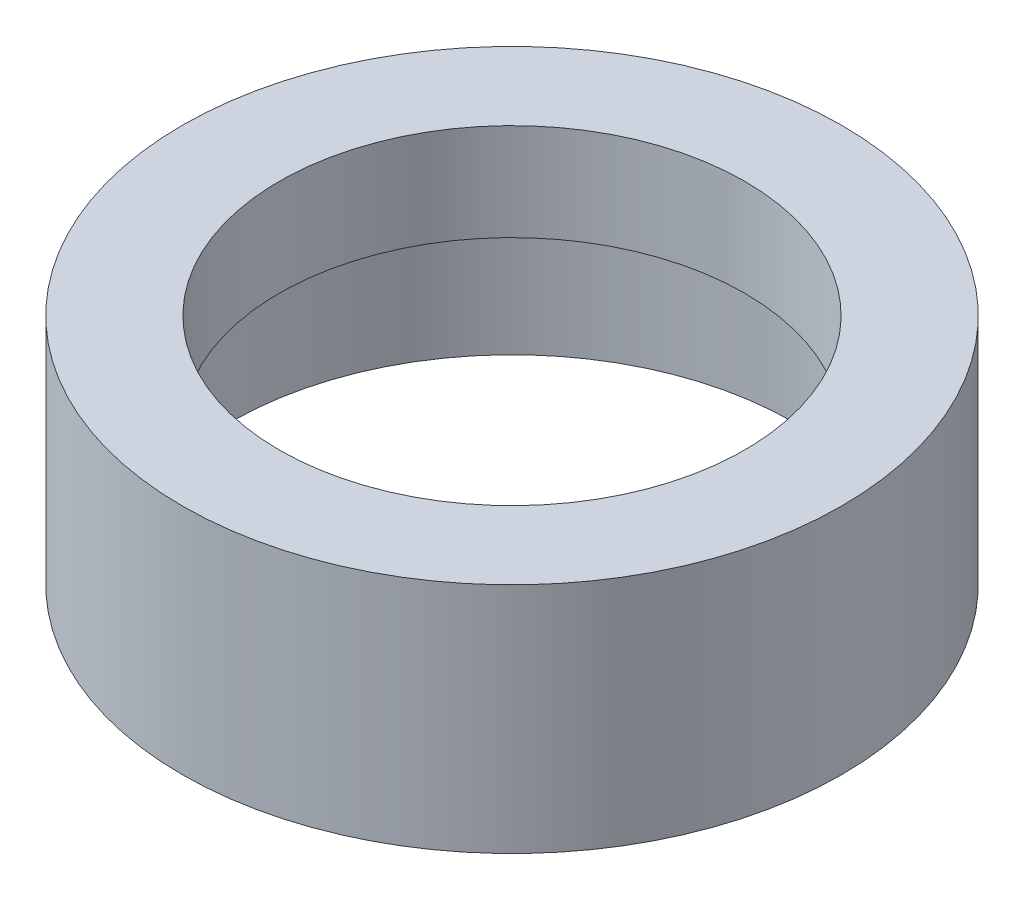
ISO-10303-21;
HEADER;
FILE_DESCRIPTION(('STEP AP214'),'2;1');
FILE_NAME('part.step','',(''),(''),'','','');
FILE_SCHEMA(('AUTOMOTIVE_DESIGN { 1 0 10303 214 1 1 1 1 }'));
ENDSEC;
DATA;
#1=APPLICATION_CONTEXT('core data for automotive mechanical design processes');
#2=APPLICATION_PROTOCOL_DEFINITION('international standard','automotive_design',2000,#1);
#3=PRODUCT_CONTEXT('',#1,'mechanical');
#4=PRODUCT('Part','Part','',(#3));
#5=PRODUCT_RELATED_PRODUCT_CATEGORY('part','',(#4));
#6=PRODUCT_DEFINITION_FORMATION('','',#4);
#7=PRODUCT_DEFINITION_CONTEXT('part definition',#1,'design');
#8=PRODUCT_DEFINITION('design','',#6,#7);
#9=PRODUCT_DEFINITION_SHAPE('','',#8);
#10=(LENGTH_UNIT() NAMED_UNIT(*) SI_UNIT(.MILLI.,.METRE.));
#11=(NAMED_UNIT(*) PLANE_ANGLE_UNIT() SI_UNIT($,.RADIAN.));
#12=(NAMED_UNIT(*) SI_UNIT($,.STERADIAN.) SOLID_ANGLE_UNIT());
#13=UNCERTAINTY_MEASURE_WITH_UNIT(LENGTH_MEASURE(1.E-05),#10,'distance_accuracy_value','');
#14=(GEOMETRIC_REPRESENTATION_CONTEXT(3) GLOBAL_UNCERTAINTY_ASSIGNED_CONTEXT((#13)) GLOBAL_UNIT_ASSIGNED_CONTEXT((#10,
#11,#12)) REPRESENTATION_CONTEXT('',''));
#15=CARTESIAN_POINT('',(0.,0.,0.));
#16=DIRECTION('',(0.,0.,1.));
#17=DIRECTION('',(1.,0.,0.));
#18=AXIS2_PLACEMENT_3D('',#15,#16,#17);
#19=CARTESIAN_POINT('',(0.,12.,0.));
#20=DIRECTION('',(0.,-1.,0.));
#21=DIRECTION('',(0.,0.,-1.));
#22=AXIS2_PLACEMENT_3D('',#19,#20,#21);
#23=CYLINDRICAL_SURFACE('',#22,12.);
#24=CARTESIAN_POINT('',(0.,12.,0.));
#25=DIRECTION('',(0.,1.,0.));
#26=DIRECTION('',(0.,0.,1.));
#27=AXIS2_PLACEMENT_3D('',#24,#25,#26);
#28=CIRCLE('',#27,12.);
#29=CARTESIAN_POINT('',(0.,12.,12.));
#30=VERTEX_POINT('',#29);
#31=EDGE_CURVE('E48',#30,#30,#28,.T.);
#32=ORIENTED_EDGE('',*,*,#31,.T.);
#33=EDGE_LOOP('',(#32));
#34=FACE_BOUND('',#33,.T.);
#35=CARTESIAN_POINT('',(0.,7.,0.));
#36=DIRECTION('',(0.,-1.,0.));
#37=DIRECTION('',(0.,0.,-1.));
#38=AXIS2_PLACEMENT_3D('',#35,#36,#37);
#39=CIRCLE('',#38,12.);
#40=CARTESIAN_POINT('',(0.,7.,-12.));
#41=VERTEX_POINT('',#40);
#42=EDGE_CURVE('E39',#41,#41,#39,.T.);
#43=ORIENTED_EDGE('',*,*,#42,.T.);
#44=EDGE_LOOP('',(#43));
#45=FACE_BOUND('',#44,.T.);
#46=ADVANCED_FACE('F35',(#34,#45),#23,.F.);
#47=CARTESIAN_POINT('',(0.,12.,0.));
#48=DIRECTION('',(0.,1.,0.));
#49=DIRECTION('',(0.,0.,1.));
#50=AXIS2_PLACEMENT_3D('',#47,#48,#49);
#51=PLANE('',#50);
#52=CARTESIAN_POINT('',(0.,12.,0.));
#53=DIRECTION('',(0.,1.,0.));
#54=DIRECTION('',(0.,0.,1.));
#55=AXIS2_PLACEMENT_3D('',#52,#53,#54);
#56=CIRCLE('',#55,17.);
#57=CARTESIAN_POINT('',(0.,12.,17.));
#58=VERTEX_POINT('',#57);
#59=EDGE_CURVE('E10',#58,#58,#56,.T.);
#60=ORIENTED_EDGE('',*,*,#59,.T.);
#61=EDGE_LOOP('',(#60));
#62=FACE_BOUND('',#61,.T.);
#63=ORIENTED_EDGE('',*,*,#31,.F.);
#64=EDGE_LOOP('',(#63));
#65=FACE_BOUND('',#64,.T.);
#66=ADVANCED_FACE('F73',(#62,#65),#51,.T.);
#67=CARTESIAN_POINT('',(0.,0.,0.));
#68=DIRECTION('',(0.,1.,0.));
#69=DIRECTION('',(0.,0.,1.));
#70=AXIS2_PLACEMENT_3D('',#67,#68,#69);
#71=PLANE('',#70);
#72=CARTESIAN_POINT('',(0.,0.,0.));
#73=DIRECTION('',(0.,-1.,0.));
#74=DIRECTION('',(0.,0.,-1.));
#75=AXIS2_PLACEMENT_3D('',#72,#73,#74);
#76=CIRCLE('',#75,14.5);
#77=CARTESIAN_POINT('',(0.,0.,-14.5));
#78=VERTEX_POINT('',#77);
#79=EDGE_CURVE('E52',#78,#78,#76,.T.);
#80=ORIENTED_EDGE('',*,*,#79,.F.);
#81=EDGE_LOOP('',(#80));
#82=FACE_BOUND('',#81,.T.);
#83=CARTESIAN_POINT('',(0.,0.,0.));
#84=DIRECTION('',(0.,1.,0.));
#85=DIRECTION('',(0.,0.,1.));
#86=AXIS2_PLACEMENT_3D('',#83,#84,#85);
#87=CIRCLE('',#86,17.);
#88=CARTESIAN_POINT('',(0.,0.,17.));
#89=VERTEX_POINT('',#88);
#90=EDGE_CURVE('E43',#89,#89,#87,.T.);
#91=ORIENTED_EDGE('',*,*,#90,.F.);
#92=EDGE_LOOP('',(#91));
#93=FACE_BOUND('',#92,.T.);
#94=ADVANCED_FACE('F79',(#82,#93),#71,.F.);
#95=CARTESIAN_POINT('',(0.,12.,0.));
#96=DIRECTION('',(0.,-1.,0.));
#97=DIRECTION('',(0.,0.,-1.));
#98=AXIS2_PLACEMENT_3D('',#95,#96,#97);
#99=CYLINDRICAL_SURFACE('',#98,17.);
#100=ORIENTED_EDGE('',*,*,#59,.F.);
#101=EDGE_LOOP('',(#100));
#102=FACE_BOUND('',#101,.T.);
#103=ORIENTED_EDGE('',*,*,#90,.T.);
#104=EDGE_LOOP('',(#103));
#105=FACE_BOUND('',#104,.T.);
#106=ADVANCED_FACE('F37',(#102,#105),#99,.T.);
#107=CARTESIAN_POINT('',(0.,7.,0.));
#108=DIRECTION('',(0.,-1.,0.));
#109=DIRECTION('',(0.,0.,-1.));
#110=AXIS2_PLACEMENT_3D('',#107,#108,#109);
#111=CYLINDRICAL_SURFACE('',#110,14.5);
#112=CARTESIAN_POINT('',(0.,7.,0.));
#113=DIRECTION('',(0.,-1.,0.));
#114=DIRECTION('',(0.,0.,-1.));
#115=AXIS2_PLACEMENT_3D('',#112,#113,#114);
#116=CIRCLE('',#115,14.5);
#117=CARTESIAN_POINT('',(0.,7.,-14.5));
#118=VERTEX_POINT('',#117);
#119=EDGE_CURVE('E55',#118,#118,#116,.T.);
#120=ORIENTED_EDGE('',*,*,#119,.F.);
#121=EDGE_LOOP('',(#120));
#122=FACE_BOUND('',#121,.T.);
#123=ORIENTED_EDGE('',*,*,#79,.T.);
#124=EDGE_LOOP('',(#123));
#125=FACE_BOUND('',#124,.T.);
#126=ADVANCED_FACE('F65',(#122,#125),#111,.F.);
#127=CARTESIAN_POINT('',(0.,7.,0.));
#128=DIRECTION('',(0.,-1.,0.));
#129=DIRECTION('',(0.,0.,-1.));
#130=AXIS2_PLACEMENT_3D('',#127,#128,#129);
#131=PLANE('',#130);
#132=ORIENTED_EDGE('',*,*,#42,.F.);
#133=EDGE_LOOP('',(#132));
#134=FACE_BOUND('',#133,.T.);
#135=ORIENTED_EDGE('',*,*,#119,.T.);
#136=EDGE_LOOP('',(#135));
#137=FACE_BOUND('',#136,.T.);
#138=ADVANCED_FACE('F63',(#134,#137),#131,.T.);
#139=CLOSED_SHELL('',(#46,#66,#94,#106,#126,#138));
#140=MANIFOLD_SOLID_BREP('B2',#139);
#141=ADVANCED_BREP_SHAPE_REPRESENTATION('',(#18,#140),#14);
#142=SHAPE_DEFINITION_REPRESENTATION(#9,#141);
ENDSEC;
END-ISO-10303-21;
